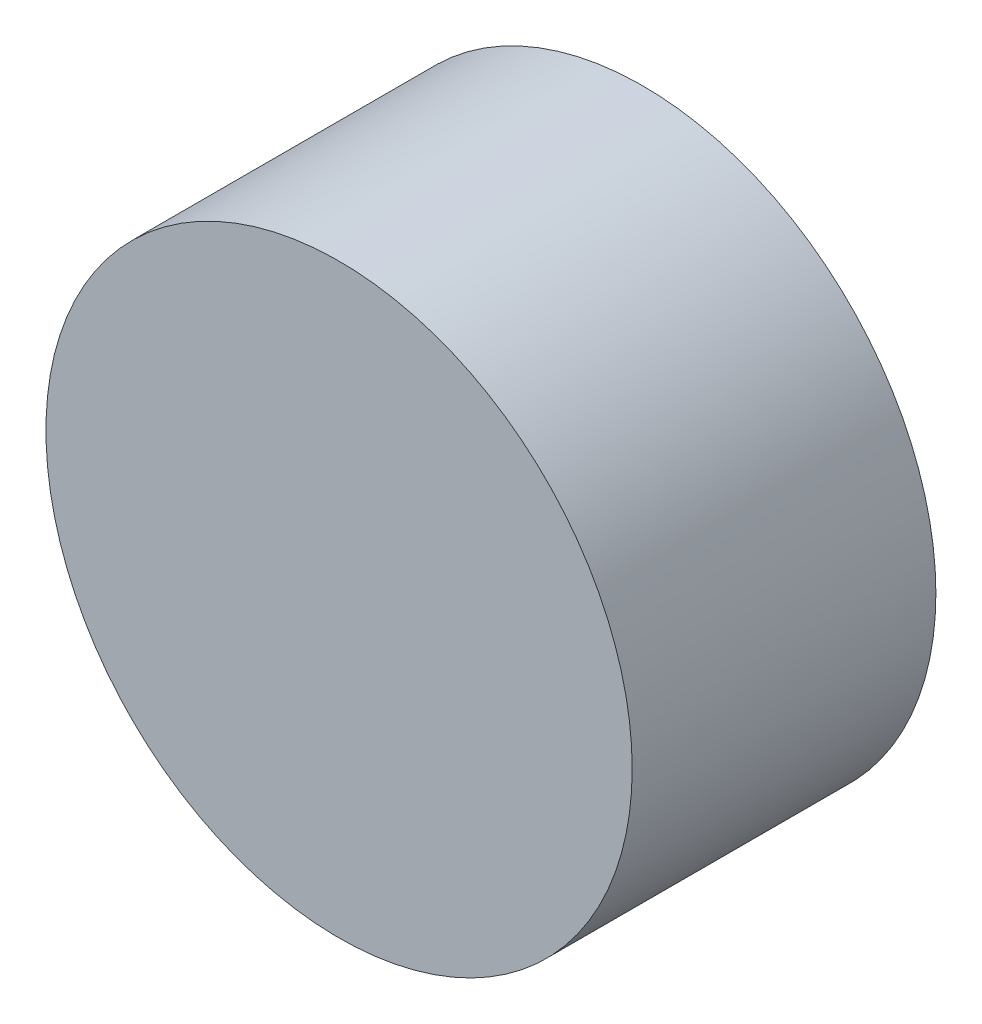
ISO-10303-21;
HEADER;
FILE_DESCRIPTION(('STEP AP214'),'2;1');
FILE_NAME('part.step','',(''),(''),'','','');
FILE_SCHEMA(('AUTOMOTIVE_DESIGN { 1 0 10303 214 1 1 1 1 }'));
ENDSEC;
DATA;
#1=APPLICATION_CONTEXT('core data for automotive mechanical design processes');
#2=APPLICATION_PROTOCOL_DEFINITION('international standard','automotive_design',2000,#1);
#3=PRODUCT_CONTEXT('',#1,'mechanical');
#4=PRODUCT('Part','Part','',(#3));
#5=PRODUCT_RELATED_PRODUCT_CATEGORY('part','',(#4));
#6=PRODUCT_DEFINITION_FORMATION('','',#4);
#7=PRODUCT_DEFINITION_CONTEXT('part definition',#1,'design');
#8=PRODUCT_DEFINITION('design','',#6,#7);
#9=PRODUCT_DEFINITION_SHAPE('','',#8);
#10=(LENGTH_UNIT() NAMED_UNIT(*) SI_UNIT(.MILLI.,.METRE.));
#11=(NAMED_UNIT(*) PLANE_ANGLE_UNIT() SI_UNIT($,.RADIAN.));
#12=(NAMED_UNIT(*) SI_UNIT($,.STERADIAN.) SOLID_ANGLE_UNIT());
#13=UNCERTAINTY_MEASURE_WITH_UNIT(LENGTH_MEASURE(1.E-05),#10,'distance_accuracy_value','');
#14=(GEOMETRIC_REPRESENTATION_CONTEXT(3) GLOBAL_UNCERTAINTY_ASSIGNED_CONTEXT((#13)) GLOBAL_UNIT_ASSIGNED_CONTEXT((#10,
#11,#12)) REPRESENTATION_CONTEXT('',''));
#15=CARTESIAN_POINT('',(0.,0.,0.));
#16=DIRECTION('',(0.,0.,1.));
#17=DIRECTION('',(1.,0.,0.));
#18=AXIS2_PLACEMENT_3D('',#15,#16,#17);
#19=CARTESIAN_POINT('',(0.,0.,5.));
#20=DIRECTION('',(0.,0.,-1.));
#21=DIRECTION('',(-1.,0.,0.));
#22=AXIS2_PLACEMENT_3D('',#19,#20,#21);
#23=CYLINDRICAL_SURFACE('',#22,4.826);
#24=CARTESIAN_POINT('',(0.,0.,5.));
#25=DIRECTION('',(0.,0.,1.));
#26=DIRECTION('',(1.,0.,0.));
#27=AXIS2_PLACEMENT_3D('',#24,#25,#26);
#28=CIRCLE('',#27,4.826);
#29=CARTESIAN_POINT('',(4.826,0.,5.));
#30=VERTEX_POINT('',#29);
#31=EDGE_CURVE('E10',#30,#30,#28,.T.);
#32=ORIENTED_EDGE('',*,*,#31,.F.);
#33=EDGE_LOOP('',(#32));
#34=FACE_BOUND('',#33,.T.);
#35=CARTESIAN_POINT('',(0.,0.,0.));
#36=DIRECTION('',(0.,0.,1.));
#37=DIRECTION('',(1.,0.,0.));
#38=AXIS2_PLACEMENT_3D('',#35,#36,#37);
#39=CIRCLE('',#38,4.826);
#40=CARTESIAN_POINT('',(4.826,0.,0.));
#41=VERTEX_POINT('',#40);
#42=EDGE_CURVE('E38',#41,#41,#39,.T.);
#43=ORIENTED_EDGE('',*,*,#42,.T.);
#44=EDGE_LOOP('',(#43));
#45=FACE_BOUND('',#44,.T.);
#46=ADVANCED_FACE('F35',(#34,#45),#23,.T.);
#47=CARTESIAN_POINT('',(0.,0.,5.));
#48=DIRECTION('',(0.,0.,1.));
#49=DIRECTION('',(1.,0.,0.));
#50=AXIS2_PLACEMENT_3D('',#47,#48,#49);
#51=PLANE('',#50);
#52=ORIENTED_EDGE('',*,*,#31,.T.);
#53=EDGE_LOOP('',(#52));
#54=FACE_BOUND('',#53,.T.);
#55=ADVANCED_FACE('F52',(#54),#51,.T.);
#56=CARTESIAN_POINT('',(0.,0.,0.));
#57=DIRECTION('',(0.,0.,1.));
#58=DIRECTION('',(1.,0.,0.));
#59=AXIS2_PLACEMENT_3D('',#56,#57,#58);
#60=PLANE('',#59);
#61=ORIENTED_EDGE('',*,*,#42,.F.);
#62=EDGE_LOOP('',(#61));
#63=FACE_BOUND('',#62,.T.);
#64=ADVANCED_FACE('F50',(#63),#60,.F.);
#65=CLOSED_SHELL('',(#46,#55,#64));
#66=MANIFOLD_SOLID_BREP('B2',#65);
#67=ADVANCED_BREP_SHAPE_REPRESENTATION('',(#18,#66),#14);
#68=SHAPE_DEFINITION_REPRESENTATION(#9,#67);
ENDSEC;
END-ISO-10303-21;
